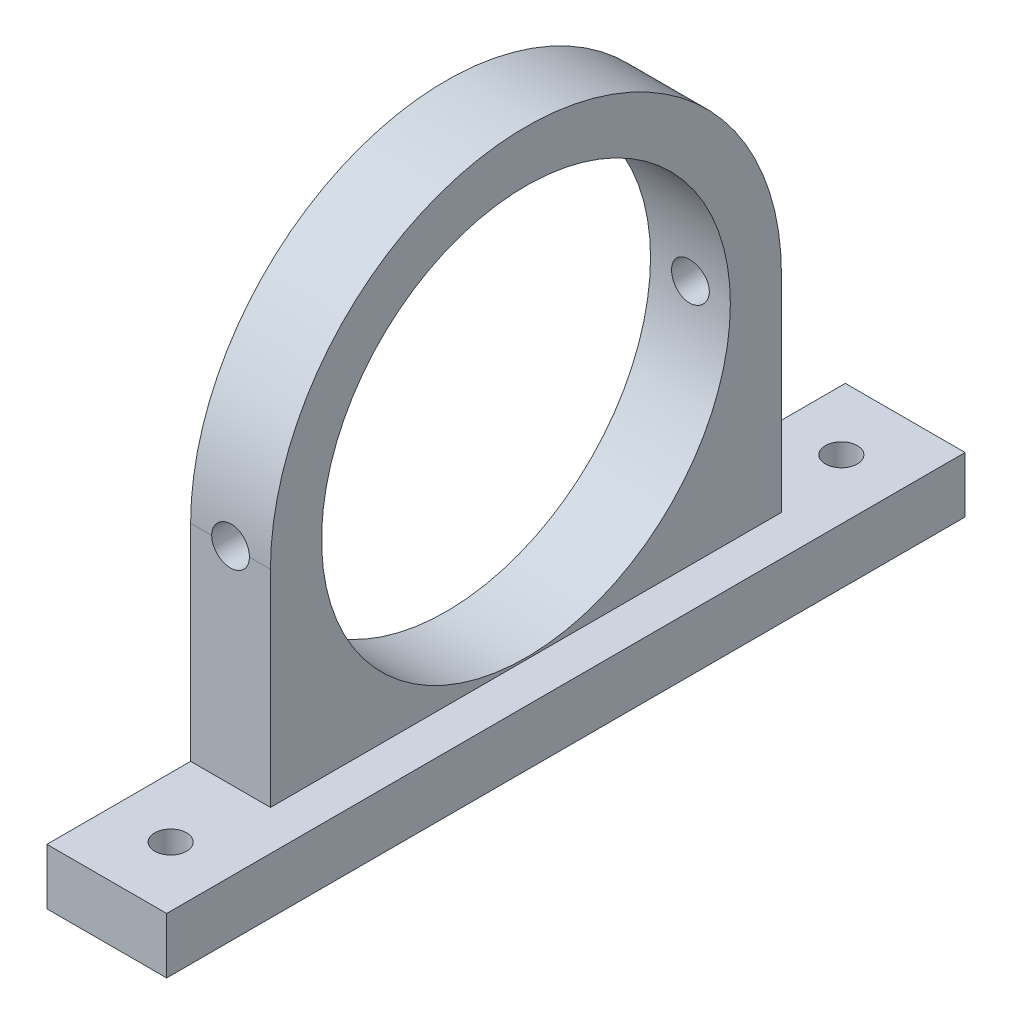
ISO-10303-21;
HEADER;
FILE_DESCRIPTION(('STEP AP214'),'2;1');
FILE_NAME('part.step','',(''),(''),'','','');
FILE_SCHEMA(('AUTOMOTIVE_DESIGN { 1 0 10303 214 1 1 1 1 }'));
ENDSEC;
DATA;
#1=APPLICATION_CONTEXT('core data for automotive mechanical design processes');
#2=APPLICATION_PROTOCOL_DEFINITION('international standard','automotive_design',2000,#1);
#3=PRODUCT_CONTEXT('',#1,'mechanical');
#4=PRODUCT('Part','Part','',(#3));
#5=PRODUCT_RELATED_PRODUCT_CATEGORY('part','',(#4));
#6=PRODUCT_DEFINITION_FORMATION('','',#4);
#7=PRODUCT_DEFINITION_CONTEXT('part definition',#1,'design');
#8=PRODUCT_DEFINITION('design','',#6,#7);
#9=PRODUCT_DEFINITION_SHAPE('','',#8);
#10=(LENGTH_UNIT() NAMED_UNIT(*) SI_UNIT(.MILLI.,.METRE.));
#11=(NAMED_UNIT(*) PLANE_ANGLE_UNIT() SI_UNIT($,.RADIAN.));
#12=(NAMED_UNIT(*) SI_UNIT($,.STERADIAN.) SOLID_ANGLE_UNIT());
#13=UNCERTAINTY_MEASURE_WITH_UNIT(LENGTH_MEASURE(1.E-05),#10,'distance_accuracy_value','');
#14=(GEOMETRIC_REPRESENTATION_CONTEXT(3) GLOBAL_UNCERTAINTY_ASSIGNED_CONTEXT((#13)) GLOBAL_UNIT_ASSIGNED_CONTEXT((#10,
#11,#12)) REPRESENTATION_CONTEXT('',''));
#15=CARTESIAN_POINT('',(0.,0.,0.));
#16=DIRECTION('',(0.,0.,1.));
#17=DIRECTION('',(1.,0.,0.));
#18=AXIS2_PLACEMENT_3D('',#15,#16,#17);
#19=CARTESIAN_POINT('',(3.175,0.,-20.32));
#20=DIRECTION('',(0.,0.,1.));
#21=DIRECTION('',(1.,0.,0.));
#22=AXIS2_PLACEMENT_3D('',#19,#20,#21);
#23=PLANE('',#22);
#24=CARTESIAN_POINT('',(0.,20.8500000000001,-20.3199999999999));
#25=DIRECTION('',(0.,0.,-1.));
#26=DIRECTION('',(0.,1.,0.));
#27=AXIS2_PLACEMENT_3D('',#24,#25,#26);
#28=CIRCLE('',#27,1.5113);
#29=CARTESIAN_POINT('',(1.5113,20.8500000000002,-20.3199999999999));
#30=VERTEX_POINT('',#29);
#31=CARTESIAN_POINT('',(-1.51130000000017,20.85,-20.32));
#32=VERTEX_POINT('',#31);
#33=EDGE_CURVE('E56',#30,#32,#28,.T.);
#34=ORIENTED_EDGE('',*,*,#33,.F.);
#35=DIRECTION('',(-1.,0.,0.));
#36=VECTOR('',#35,1.);
#37=CARTESIAN_POINT('',(3.175,20.85,-20.32));
#38=LINE('',#37,#36);
#39=CARTESIAN_POINT('',(3.175,20.85,-20.32));
#40=VERTEX_POINT('',#39);
#41=EDGE_CURVE('E141',#40,#30,#38,.T.);
#42=ORIENTED_EDGE('',*,*,#41,.F.);
#43=DIRECTION('',(0.,1.,0.));
#44=VECTOR('',#43,1.);
#45=CARTESIAN_POINT('',(3.175,0.,-20.32));
#46=LINE('',#45,#44);
#47=CARTESIAN_POINT('',(3.175,4.445,-20.32));
#48=VERTEX_POINT('',#47);
#49=EDGE_CURVE('E220',#48,#40,#46,.T.);
#50=ORIENTED_EDGE('',*,*,#49,.F.);
#51=DIRECTION('',(-1.,0.,0.));
#52=VECTOR('',#51,1.);
#53=CARTESIAN_POINT('',(3.175,4.445,-20.32));
#54=LINE('',#53,#52);
#55=CARTESIAN_POINT('',(-3.175,4.445,-20.32));
#56=VERTEX_POINT('',#55);
#57=EDGE_CURVE('E146',#48,#56,#54,.T.);
#58=ORIENTED_EDGE('',*,*,#57,.T.);
#59=DIRECTION('',(0.,1.,0.));
#60=VECTOR('',#59,1.);
#61=CARTESIAN_POINT('',(-3.175,0.,-20.32));
#62=LINE('',#61,#60);
#63=CARTESIAN_POINT('',(-3.175,20.85,-20.32));
#64=VERTEX_POINT('',#63);
#65=EDGE_CURVE('E244',#56,#64,#62,.T.);
#66=ORIENTED_EDGE('',*,*,#65,.T.);
#67=EDGE_CURVE('E147',#32,#64,#38,.T.);
#68=ORIENTED_EDGE('',*,*,#67,.F.);
#69=EDGE_LOOP('',(#34,#42,#50,#58,#66,#68));
#70=FACE_BOUND('',#69,.T.);
#71=ADVANCED_FACE('F36',(#70),#23,.F.);
#72=CARTESIAN_POINT('',(3.175,0.,31.75));
#73=DIRECTION('',(0.,0.,1.));
#74=DIRECTION('',(1.,0.,0.));
#75=AXIS2_PLACEMENT_3D('',#72,#73,#74);
#76=PLANE('',#75);
#77=DIRECTION('',(0.,1.,0.));
#78=VECTOR('',#77,1.);
#79=CARTESIAN_POINT('',(-3.175,0.,31.75));
#80=LINE('',#79,#78);
#81=CARTESIAN_POINT('',(-3.175,0.,31.75));
#82=VERTEX_POINT('',#81);
#83=CARTESIAN_POINT('',(-3.175,4.445,31.75));
#84=VERTEX_POINT('',#83);
#85=EDGE_CURVE('E234',#82,#84,#80,.T.);
#86=ORIENTED_EDGE('',*,*,#85,.F.);
#87=DIRECTION('',(-1.,0.,0.));
#88=VECTOR('',#87,1.);
#89=CARTESIAN_POINT('',(3.175,0.,31.75));
#90=LINE('',#89,#88);
#91=CARTESIAN_POINT('',(6.35,0.,31.75));
#92=VERTEX_POINT('',#91);
#93=EDGE_CURVE('E158',#92,#82,#90,.T.);
#94=ORIENTED_EDGE('',*,*,#93,.F.);
#95=DIRECTION('',(0.,-1.,0.));
#96=VECTOR('',#95,1.);
#97=CARTESIAN_POINT('',(6.35,0.,31.75));
#98=LINE('',#97,#96);
#99=CARTESIAN_POINT('',(6.35,4.445,31.75));
#100=VERTEX_POINT('',#99);
#101=EDGE_CURVE('E218',#100,#92,#98,.T.);
#102=ORIENTED_EDGE('',*,*,#101,.F.);
#103=DIRECTION('',(-1.,0.,0.));
#104=VECTOR('',#103,1.);
#105=CARTESIAN_POINT('',(3.175,4.445,31.75));
#106=LINE('',#105,#104);
#107=EDGE_CURVE('E160',#100,#84,#106,.T.);
#108=ORIENTED_EDGE('',*,*,#107,.T.);
#109=EDGE_LOOP('',(#86,#94,#102,#108));
#110=FACE_BOUND('',#109,.T.);
#111=ADVANCED_FACE('F38',(#110),#76,.T.);
#112=CARTESIAN_POINT('',(3.175,0.,0.));
#113=DIRECTION('',(0.,-1.,0.));
#114=DIRECTION('',(0.,0.,-1.));
#115=AXIS2_PLACEMENT_3D('',#112,#113,#114);
#116=PLANE('',#115);
#117=CARTESIAN_POINT('',(1.5875,0.,-26.67));
#118=DIRECTION('',(0.,-1.,0.));
#119=DIRECTION('',(0.,0.,-1.));
#120=AXIS2_PLACEMENT_3D('',#117,#118,#119);
#121=CIRCLE('',#120,1.27);
#122=CARTESIAN_POINT('',(1.5875,0.,-27.94));
#123=VERTEX_POINT('',#122);
#124=EDGE_CURVE('E339',#123,#123,#121,.F.);
#125=ORIENTED_EDGE('',*,*,#124,.T.);
#126=EDGE_LOOP('',(#125));
#127=FACE_BOUND('',#126,.T.);
#128=CARTESIAN_POINT('',(1.5875,0.,26.67));
#129=DIRECTION('',(0.,-1.,0.));
#130=DIRECTION('',(0.,0.,-1.));
#131=AXIS2_PLACEMENT_3D('',#128,#129,#130);
#132=CIRCLE('',#131,1.27);
#133=CARTESIAN_POINT('',(1.5875,0.,25.4));
#134=VERTEX_POINT('',#133);
#135=EDGE_CURVE('E338',#134,#134,#132,.T.);
#136=ORIENTED_EDGE('',*,*,#135,.F.);
#137=EDGE_LOOP('',(#136));
#138=FACE_BOUND('',#137,.T.);
#139=DIRECTION('',(0.,0.,1.));
#140=VECTOR('',#139,1.);
#141=CARTESIAN_POINT('',(-3.175,0.,0.));
#142=LINE('',#141,#140);
#143=CARTESIAN_POINT('',(-3.175,0.,-31.75));
#144=VERTEX_POINT('',#143);
#145=EDGE_CURVE('E238',#144,#82,#142,.T.);
#146=ORIENTED_EDGE('',*,*,#145,.F.);
#147=DIRECTION('',(-1.,0.,0.));
#148=VECTOR('',#147,1.);
#149=CARTESIAN_POINT('',(3.175,0.,-31.75));
#150=LINE('',#149,#148);
#151=CARTESIAN_POINT('',(6.35,0.,-31.75));
#152=VERTEX_POINT('',#151);
#153=EDGE_CURVE('E156',#152,#144,#150,.T.);
#154=ORIENTED_EDGE('',*,*,#153,.F.);
#155=DIRECTION('',(0.,0.,-1.));
#156=VECTOR('',#155,1.);
#157=CARTESIAN_POINT('',(6.35,0.,-31.75));
#158=LINE('',#157,#156);
#159=EDGE_CURVE('E286',#92,#152,#158,.T.);
#160=ORIENTED_EDGE('',*,*,#159,.F.);
#161=ORIENTED_EDGE('',*,*,#93,.T.);
#162=EDGE_LOOP('',(#146,#154,#160,#161));
#163=FACE_BOUND('',#162,.T.);
#164=ADVANCED_FACE('F282',(#127,#138,#163),#116,.T.);
#165=CARTESIAN_POINT('',(3.175,0.,-31.75));
#166=DIRECTION('',(0.,0.,1.));
#167=DIRECTION('',(1.,0.,0.));
#168=AXIS2_PLACEMENT_3D('',#165,#166,#167);
#169=PLANE('',#168);
#170=DIRECTION('',(0.,1.,0.));
#171=VECTOR('',#170,1.);
#172=CARTESIAN_POINT('',(-3.175,0.,-31.75));
#173=LINE('',#172,#171);
#174=CARTESIAN_POINT('',(-3.175,4.445,-31.75));
#175=VERTEX_POINT('',#174);
#176=EDGE_CURVE('E241',#144,#175,#173,.T.);
#177=ORIENTED_EDGE('',*,*,#176,.T.);
#178=DIRECTION('',(-1.,0.,0.));
#179=VECTOR('',#178,1.);
#180=CARTESIAN_POINT('',(3.175,4.445,-31.75));
#181=LINE('',#180,#179);
#182=CARTESIAN_POINT('',(6.35,4.445,-31.75));
#183=VERTEX_POINT('',#182);
#184=EDGE_CURVE('E149',#183,#175,#181,.T.);
#185=ORIENTED_EDGE('',*,*,#184,.F.);
#186=DIRECTION('',(0.,1.,0.));
#187=VECTOR('',#186,1.);
#188=CARTESIAN_POINT('',(6.35,0.,-31.75));
#189=LINE('',#188,#187);
#190=EDGE_CURVE('E291',#152,#183,#189,.T.);
#191=ORIENTED_EDGE('',*,*,#190,.F.);
#192=ORIENTED_EDGE('',*,*,#153,.T.);
#193=EDGE_LOOP('',(#177,#185,#191,#192));
#194=FACE_BOUND('',#193,.T.);
#195=ADVANCED_FACE('F279',(#194),#169,.F.);
#196=CARTESIAN_POINT('',(3.175,4.445,0.));
#197=DIRECTION('',(0.,1.,0.));
#198=DIRECTION('',(0.,0.,1.));
#199=AXIS2_PLACEMENT_3D('',#196,#197,#198);
#200=PLANE('',#199);
#201=CARTESIAN_POINT('',(1.5875,4.445,-26.67));
#202=DIRECTION('',(0.,-1.,0.));
#203=DIRECTION('',(0.,0.,-1.));
#204=AXIS2_PLACEMENT_3D('',#201,#202,#203);
#205=CIRCLE('',#204,1.27);
#206=CARTESIAN_POINT('',(1.5875,4.445,-27.94));
#207=VERTEX_POINT('',#206);
#208=EDGE_CURVE('E333',#207,#207,#205,.T.);
#209=ORIENTED_EDGE('',*,*,#208,.T.);
#210=EDGE_LOOP('',(#209));
#211=FACE_BOUND('',#210,.T.);
#212=CARTESIAN_POINT('',(1.5875,4.445,26.67));
#213=DIRECTION('',(0.,1.,0.));
#214=DIRECTION('',(0.,0.,1.));
#215=AXIS2_PLACEMENT_3D('',#212,#213,#214);
#216=CIRCLE('',#215,1.27);
#217=CARTESIAN_POINT('',(1.5875,4.445,27.94));
#218=VERTEX_POINT('',#217);
#219=EDGE_CURVE('E336',#218,#218,#216,.T.);
#220=ORIENTED_EDGE('',*,*,#219,.F.);
#221=EDGE_LOOP('',(#220));
#222=FACE_BOUND('',#221,.T.);
#223=DIRECTION('',(0.,0.,-1.));
#224=VECTOR('',#223,1.);
#225=CARTESIAN_POINT('',(-3.175,4.445,0.));
#226=LINE('',#225,#224);
#227=EDGE_CURVE('E235',#56,#175,#226,.T.);
#228=ORIENTED_EDGE('',*,*,#227,.F.);
#229=ORIENTED_EDGE('',*,*,#57,.F.);
#230=DIRECTION('',(0.,0.,1.));
#231=VECTOR('',#230,1.);
#232=CARTESIAN_POINT('',(3.175,4.445,31.75));
#233=LINE('',#232,#231);
#234=CARTESIAN_POINT('',(3.175,4.445,20.32));
#235=VERTEX_POINT('',#234);
#236=EDGE_CURVE('E162',#48,#235,#233,.T.);
#237=ORIENTED_EDGE('',*,*,#236,.T.);
#238=DIRECTION('',(-1.,0.,0.));
#239=VECTOR('',#238,1.);
#240=CARTESIAN_POINT('',(3.175,4.445,20.32));
#241=LINE('',#240,#239);
#242=CARTESIAN_POINT('',(-3.175,4.445,20.32));
#243=VERTEX_POINT('',#242);
#244=EDGE_CURVE('E230',#235,#243,#241,.T.);
#245=ORIENTED_EDGE('',*,*,#244,.T.);
#246=EDGE_CURVE('E231',#84,#243,#226,.T.);
#247=ORIENTED_EDGE('',*,*,#246,.F.);
#248=ORIENTED_EDGE('',*,*,#107,.F.);
#249=DIRECTION('',(0.,0.,1.));
#250=VECTOR('',#249,1.);
#251=CARTESIAN_POINT('',(6.35,4.445,31.75));
#252=LINE('',#251,#250);
#253=EDGE_CURVE('E275',#183,#100,#252,.T.);
#254=ORIENTED_EDGE('',*,*,#253,.F.);
#255=ORIENTED_EDGE('',*,*,#184,.T.);
#256=EDGE_LOOP('',(#228,#229,#237,#245,#247,#248,#254,#255));
#257=FACE_BOUND('',#256,.T.);
#258=ADVANCED_FACE('F203',(#211,#222,#257),#200,.T.);
#259=CARTESIAN_POINT('',(3.175,20.85,0.));
#260=DIRECTION('',(-1.,0.,0.));
#261=DIRECTION('',(0.,0.,1.));
#262=AXIS2_PLACEMENT_3D('',#259,#260,#261);
#263=CYLINDRICAL_SURFACE('',#262,20.32);
#264=CARTESIAN_POINT('',(1.500000048,20.85,20.32));
#265=CARTESIAN_POINT('',(1.49999983587005,20.8921400952631,20.3200007331279));
#266=CARTESIAN_POINT('',(1.49822314498622,20.9342599462541,20.3198687467585));
#267=CARTESIAN_POINT('',(1.49113564784249,21.0181971462007,20.3193471095665));
#268=CARTESIAN_POINT('',(1.48582504611599,21.0600145125217,20.3189574736559));
#269=CARTESIAN_POINT('',(1.4646444564112,21.1844854300185,20.3174154853349));
#270=CARTESIAN_POINT('',(1.44352553475765,21.266303431948,20.3158900003548));
#271=CARTESIAN_POINT('',(1.3878852984627,21.4252172582659,20.312012809638));
#272=CARTESIAN_POINT('',(1.3533583976225,21.5023110988948,20.3096607595662));
#273=CARTESIAN_POINT('',(1.2718901292436,21.6496085785074,20.3043950497946));
#274=CARTESIAN_POINT('',(1.22495068924397,21.7198132849836,20.3014814773124));
#275=CARTESIAN_POINT('',(1.11989277454509,21.8514722977573,20.2954136048815));
#276=CARTESIAN_POINT('',(1.06175531866697,21.9129114337204,20.2922589017606));
#277=CARTESIAN_POINT('',(0.935983476281679,22.0251770996436,20.2860673293668));
#278=CARTESIAN_POINT('',(0.868347644264949,22.0760020113454,20.2830304781192));
#279=CARTESIAN_POINT('',(0.725411715813101,22.165637555332,20.2774141487992));
#280=CARTESIAN_POINT('',(0.650103182236045,22.2044347679339,20.2748351829646));
#281=CARTESIAN_POINT('',(0.494023351415337,22.2688259574698,20.2704311863708));
#282=CARTESIAN_POINT('',(0.413252465868012,22.2944209282023,20.2686060988655));
#283=CARTESIAN_POINT('',(0.248692388214075,22.3316394966262,20.2659195598592));
#284=CARTESIAN_POINT('',(0.164908956834858,22.3432884368658,20.2650563606253));
#285=CARTESIAN_POINT('',(-0.003430209858871,22.3523626092793,20.2643857132789));
#286=CARTESIAN_POINT('',(-0.0879859525044627,22.3497877062946,20.2645782751984));
#287=CARTESIAN_POINT('',(-0.255291655386111,22.330507763423,20.2659958500506));
#288=CARTESIAN_POINT('',(-0.338044850434374,22.3138306234251,20.2672188243964));
#289=CARTESIAN_POINT('',(-0.499573774818422,22.2668629761492,20.2705562057428));
#290=CARTESIAN_POINT('',(-0.578349491168769,22.2365724244303,20.2726706156536));
#291=CARTESIAN_POINT('',(-0.7297784949524,22.1632056693041,20.277555009273));
#292=CARTESIAN_POINT('',(-0.80242553509377,22.1201166171597,20.2803256512204));
#293=CARTESIAN_POINT('',(-0.939462898383264,22.0223872746132,20.2862095070852));
#294=CARTESIAN_POINT('',(-1.00385347497475,21.9677473389177,20.2893227104817));
#295=CARTESIAN_POINT('',(-1.12270769278604,21.8483193458721,20.2955496161446));
#296=CARTESIAN_POINT('',(-1.17714854042651,21.7835086039477,20.2986633035978));
#297=CARTESIAN_POINT('',(-1.2743979183403,21.6456300648417,20.3045345933432));
#298=CARTESIAN_POINT('',(-1.31720283996456,21.5725597160333,20.3072920850296));
#299=CARTESIAN_POINT('',(-1.38996187626789,21.4202124161279,20.3121409515968));
#300=CARTESIAN_POINT('',(-1.4199072741352,21.3409312979778,20.3142318743982));
#301=CARTESIAN_POINT('',(-1.46601021321444,21.1785080755346,20.3175059570439));
#302=CARTESIAN_POINT('',(-1.48218869547125,21.0953720388923,20.3186904953246));
#303=CARTESIAN_POINT('',(-1.49418333522326,20.9847228614175,20.3195713766483));
#304=CARTESIAN_POINT('',(-1.49636571930293,20.9578009745128,20.3197320200334));
#305=CARTESIAN_POINT('',(-1.49927209495763,20.9039230844668,20.3199461940273));
#306=CARTESIAN_POINT('',(-1.49999850870271,20.8769672127623,20.3199999025334));
#307=CARTESIAN_POINT('',(-1.500000048,20.85,20.32));
#308=B_SPLINE_CURVE_WITH_KNOTS('',3,(#264,#265,#266,#267,#268,#269,#270,#271,#272,#273,#274,
#275,#276,#277,#278,#279,#280,#281,#282,#283,#284,#285,#286,#287,#288,#289,#290,#291,#292,#293,
#294,#295,#296,#297,#298,#299,#300,#301,#302,#303,#304,#305,#306,#307),.UNSPECIFIED.,.F.,.F.,(4,
2,2,2,2,2,2,2,2,2,2,2,2,2,2,2,2,2,2,2,2,4),(0.,0.126342457749605,0.252677603768744,
0.504916571643246,0.757260743393832,1.0095657516908,1.26230225387807,1.51507726051383,
1.7681332895295,2.02117026697576,2.27374672751432,2.52632558810391,2.77840591223494,
3.03048705928981,3.28282213728501,3.53514946765702,3.78804779427124,4.04102446297986,
4.29417234195641,4.54693446234536,4.62793846464693,4.70880759547446),.UNSPECIFIED.);
#309=CARTESIAN_POINT('',(1.500000048,20.85,20.32));
#310=VERTEX_POINT('',#309);
#311=CARTESIAN_POINT('',(-1.500000048,20.85,20.32));
#312=VERTEX_POINT('',#311);
#313=EDGE_CURVE('E131',#310,#312,#308,.T.);
#314=ORIENTED_EDGE('',*,*,#313,.F.);
#315=DIRECTION('',(-1.,0.,0.));
#316=VECTOR('',#315,1.);
#317=CARTESIAN_POINT('',(3.175,20.85,20.32));
#318=LINE('',#317,#316);
#319=CARTESIAN_POINT('',(3.175,20.85,20.32));
#320=VERTEX_POINT('',#319);
#321=EDGE_CURVE('E151',#320,#310,#318,.T.);
#322=ORIENTED_EDGE('',*,*,#321,.F.);
#323=CARTESIAN_POINT('',(3.175,20.85,0.));
#324=DIRECTION('',(1.,0.,0.));
#325=DIRECTION('',(0.,0.,-1.));
#326=AXIS2_PLACEMENT_3D('',#323,#324,#325);
#327=CIRCLE('',#326,20.32);
#328=EDGE_CURVE('E143',#320,#40,#327,.F.);
#329=ORIENTED_EDGE('',*,*,#328,.T.);
#330=ORIENTED_EDGE('',*,*,#41,.T.);
#331=CARTESIAN_POINT('',(1.34685122903031,21.5071824292716,-20.3093700358888));
#332=CARTESIAN_POINT('',(1.38094452601419,21.4430768130744,-20.3114542048142));
#333=CARTESIAN_POINT('',(1.41006112285406,21.3763030627661,-20.3133014348057));
#334=CARTESIAN_POINT('',(1.45716548978022,21.240620312264,-20.3163534791984));
#335=CARTESIAN_POINT('',(1.4753897560106,21.1717935986033,-20.317571860513));
#336=CARTESIAN_POINT('',(1.50036038159987,21.0363116990314,-20.3192519144608));
#337=CARTESIAN_POINT('',(1.50772461894439,20.9697706227639,-20.3197542624667));
#338=CARTESIAN_POINT('',(1.51290358214616,20.8348678348415,-20.3201111037872));
#339=CARTESIAN_POINT('',(1.5105073729729,20.7664979752316,-20.3199512856236));
#340=CARTESIAN_POINT('',(1.50302943949242,20.69867,-20.3194364890147));
#341=B_SPLINE_CURVE_WITH_KNOTS('',3,(#331,#332,#333,#334,#335,#336,#337,#338,#339,#340),
.UNSPECIFIED.,.F.,.F.,(4,2,2,2,4),(0.,0.217722021741247,0.430526715072884,0.630681849396229,
0.835185275993468),.UNSPECIFIED.);
#342=CARTESIAN_POINT('',(1.36555859752515,21.4706849931529,-20.3105182144443));
#343=VERTEX_POINT('',#342);
#344=EDGE_CURVE('E11',#343,#30,#341,.T.);
#345=ORIENTED_EDGE('',*,*,#344,.F.);
#346=CARTESIAN_POINT('',(-1.36555859752515,21.4706849931529,-20.3105182144443));
#347=CARTESIAN_POINT('',(-1.34808563523262,21.5091262377826,-20.3093439327099));
#348=CARTESIAN_POINT('',(-1.32899844659242,21.546808667928,-20.3080825713122));
#349=CARTESIAN_POINT('',(-1.28772136657057,21.6204261446339,-20.3054228426025));
#350=CARTESIAN_POINT('',(-1.2655316502958,21.6563612896572,-20.304024483024));
#351=CARTESIAN_POINT('',(-1.19456927040162,21.7610966144915,-20.2996840137558));
#352=CARTESIAN_POINT('',(-1.1413470834839,21.8269501900224,-20.2965925486025));
#353=CARTESIAN_POINT('',(-1.02460558027596,21.9487785119641,-20.2903628727136));
#354=CARTESIAN_POINT('',(-0.961081821742843,22.0047489747328,-20.2872246423444));
#355=CARTESIAN_POINT('',(-0.825532493552681,22.1052323252488,-20.2812556130008));
#356=CARTESIAN_POINT('',(-0.753508516410576,22.1497473542156,-20.2784247566302));
#357=CARTESIAN_POINT('',(-0.602983510980622,22.226057189463,-20.2733898765727));
#358=CARTESIAN_POINT('',(-0.524481849126082,22.2578507497044,-20.2711859142947));
#359=CARTESIAN_POINT('',(-0.363223601936304,22.3078044298454,-20.2676549718764));
#360=CARTESIAN_POINT('',(-0.280466518795632,22.3259629508037,-20.2663280945914));
#361=CARTESIAN_POINT('',(-0.113264275713124,22.3480875994359,-20.2647047483395));
#362=CARTESIAN_POINT('',(-0.0288235231895242,22.3520868662506,-20.2644058734231));
#363=CARTESIAN_POINT('',(0.139527342982087,22.345869978053,-20.2648657062601));
#364=CARTESIAN_POINT('',(0.223437475597961,22.3356543340941,-20.2656243759928));
#365=CARTESIAN_POINT('',(0.388234923659923,22.3013266775786,-20.2681114812779));
#366=CARTESIAN_POINT('',(0.469126028554555,22.2772327554805,-20.2698386543001));
#367=CARTESIAN_POINT('',(0.625715693727424,22.2158519512826,-20.2740669027828));
#368=CARTESIAN_POINT('',(0.701414265068216,22.178565097291,-20.2765679765944));
#369=CARTESIAN_POINT('',(0.845619679815749,22.0917824626708,-20.2820675206806));
#370=CARTESIAN_POINT('',(0.914113059382728,22.0422643846195,-20.2850668960485));
#371=CARTESIAN_POINT('',(1.04182172017819,21.9324487216477,-20.2912227367372));
#372=CARTESIAN_POINT('',(1.10103905803975,21.8721535325346,-20.2943791670314));
#373=CARTESIAN_POINT('',(1.1971656593633,21.7562058633118,-20.2998473099951));
#374=CARTESIAN_POINT('',(1.23614588165523,21.7022552941351,-20.3021967980727));
#375=CARTESIAN_POINT('',(1.30661198434627,21.5897192618909,-20.306610338306));
#376=CARTESIAN_POINT('',(1.33810432114868,21.5311378502603,-20.3086746357181));
#377=CARTESIAN_POINT('',(1.36555859752515,21.4706849931529,-20.3105182144443));
#378=B_SPLINE_CURVE_WITH_KNOTS('',3,(#346,#347,#348,#349,#350,#351,#352,#353,#354,#355,#356,
#357,#358,#359,#360,#361,#362,#363,#364,#365,#366,#367,#368,#369,#370,#371,#372,#373,#374,#375,
#376,#377),.UNSPECIFIED.,.F.,.F.,(4,2,2,2,2,2,2,2,2,2,2,2,2,2,2,4),(0.,0.126648729331324,
0.25329031348222,0.506171308147987,0.759161641527465,1.01210465221579,1.26507243203993,
1.51806987202947,1.7704747892421,2.0228706322444,2.27493821717004,2.52700526505577,
2.7795352651337,3.03200919615469,3.23124609149022,3.43031056741027),.UNSPECIFIED.);
#379=CARTESIAN_POINT('',(-1.36555859752515,21.4706849931529,-20.3105182144443));
#380=VERTEX_POINT('',#379);
#381=EDGE_CURVE('E124',#380,#343,#378,.T.);
#382=ORIENTED_EDGE('',*,*,#381,.F.);
#383=CARTESIAN_POINT('',(-1.50302943949242,20.69867,-20.3194364890147));
#384=CARTESIAN_POINT('',(-1.51107951662369,20.7715317014277,-20.3199926302962));
#385=CARTESIAN_POINT('',(-1.51324099896157,20.8450286780497,-20.3201347165824));
#386=CARTESIAN_POINT('',(-1.5060853141641,20.9897818027216,-20.3196417995429));
#387=CARTESIAN_POINT('',(-1.49702830115987,21.0610508773845,-20.3190244105114));
#388=CARTESIAN_POINT('',(-1.46917970376695,21.195968084893,-20.3171584172581));
#389=CARTESIAN_POINT('',(-1.45118347971981,21.2597828226785,-20.3159615615261));
#390=CARTESIAN_POINT('',(-1.40596628966257,21.3856012906166,-20.313041050484));
#391=CARTESIAN_POINT('',(-1.37855525327475,21.4475365549192,-20.3113066190132));
#392=CARTESIAN_POINT('',(-1.34685122903031,21.5071824292716,-20.3093700358888));
#393=B_SPLINE_CURVE_WITH_KNOTS('',3,(#383,#384,#385,#386,#387,#388,#389,#390,#391,#392),
.UNSPECIFIED.,.F.,.F.,(4,2,2,2,4),(0.,0.219667837513881,0.434335653724413,0.632626528111379,
0.835181997982693),.UNSPECIFIED.);
#394=EDGE_CURVE('E50',#32,#380,#393,.T.);
#395=ORIENTED_EDGE('',*,*,#394,.F.);
#396=ORIENTED_EDGE('',*,*,#67,.T.);
#397=CARTESIAN_POINT('',(-3.175,20.85,0.));
#398=DIRECTION('',(1.,0.,0.));
#399=DIRECTION('',(0.,0.,-1.));
#400=AXIS2_PLACEMENT_3D('',#397,#398,#399);
#401=CIRCLE('',#400,20.32);
#402=CARTESIAN_POINT('',(-3.175,20.85,20.32));
#403=VERTEX_POINT('',#402);
#404=EDGE_CURVE('E247',#403,#64,#401,.F.);
#405=ORIENTED_EDGE('',*,*,#404,.F.);
#406=EDGE_CURVE('E254',#312,#403,#318,.T.);
#407=ORIENTED_EDGE('',*,*,#406,.F.);
#408=EDGE_LOOP('',(#314,#322,#329,#330,#345,#382,#395,#396,#405,#407));
#409=FACE_BOUND('',#408,.T.);
#410=ADVANCED_FACE('F138',(#409),#263,.T.);
#411=CARTESIAN_POINT('',(3.175,0.,20.32));
#412=DIRECTION('',(0.,0.,1.));
#413=DIRECTION('',(1.,0.,0.));
#414=AXIS2_PLACEMENT_3D('',#411,#412,#413);
#415=PLANE('',#414);
#416=CARTESIAN_POINT('',(0.,20.8499999999998,20.32));
#417=DIRECTION('',(0.,0.,1.));
#418=DIRECTION('',(1.,0.,0.));
#419=AXIS2_PLACEMENT_3D('',#416,#417,#418);
#420=CIRCLE('',#419,1.500000048);
#421=EDGE_CURVE('E63',#312,#310,#420,.T.);
#422=ORIENTED_EDGE('',*,*,#421,.F.);
#423=ORIENTED_EDGE('',*,*,#406,.T.);
#424=DIRECTION('',(0.,1.,0.));
#425=VECTOR('',#424,1.);
#426=CARTESIAN_POINT('',(-3.175,0.,20.32));
#427=LINE('',#426,#425);
#428=EDGE_CURVE('E250',#243,#403,#427,.T.);
#429=ORIENTED_EDGE('',*,*,#428,.F.);
#430=ORIENTED_EDGE('',*,*,#244,.F.);
#431=DIRECTION('',(0.,1.,0.));
#432=VECTOR('',#431,1.);
#433=CARTESIAN_POINT('',(3.175,0.,20.32));
#434=LINE('',#433,#432);
#435=EDGE_CURVE('E224',#235,#320,#434,.T.);
#436=ORIENTED_EDGE('',*,*,#435,.T.);
#437=ORIENTED_EDGE('',*,*,#321,.T.);
#438=EDGE_LOOP('',(#422,#423,#429,#430,#436,#437));
#439=FACE_BOUND('',#438,.T.);
#440=ADVANCED_FACE('F202',(#439),#415,.T.);
#441=CARTESIAN_POINT('',(3.175,20.85,0.));
#442=DIRECTION('',(-1.,0.,0.));
#443=DIRECTION('',(0.,0.,1.));
#444=AXIS2_PLACEMENT_3D('',#441,#442,#443);
#445=CYLINDRICAL_SURFACE('',#444,16.256);
#446=CARTESIAN_POINT('',(1.500000048,20.85,16.256));
#447=CARTESIAN_POINT('',(1.49999639191281,20.7659361322014,16.2559991005268));
#448=CARTESIAN_POINT('',(1.49290953256135,20.681815883796,16.2553409870406));
#449=CARTESIAN_POINT('',(1.46474435756792,20.5159052419545,16.2527789213239));
#450=CARTESIAN_POINT('',(1.44365041492887,20.4341175572525,16.2508735776553));
#451=CARTESIAN_POINT('',(1.38808837838571,20.2752987824025,16.2460322444789));
#452=CARTESIAN_POINT('',(1.35362811448762,20.1982649380162,16.243096858467));
#453=CARTESIAN_POINT('',(1.27232626755218,20.0510923908959,16.236524134361));
#454=CARTESIAN_POINT('',(1.22548723696591,19.9809522707899,16.2328869410185));
#455=CARTESIAN_POINT('',(1.12060176232974,19.8493239436691,16.2253058158185));
#456=CARTESIAN_POINT('',(1.0625249276535,19.7878599975059,16.2213610699145));
#457=CARTESIAN_POINT('',(0.936877005872284,19.6755371132343,16.2136162157909));
#458=CARTESIAN_POINT('',(0.869305490765618,19.6246786534573,16.2098161141012));
#459=CARTESIAN_POINT('',(0.726436652485465,19.5349261784501,16.2027823072587));
#460=CARTESIAN_POINT('',(0.651125658704052,19.4960538365418,16.1995496326206));
#461=CARTESIAN_POINT('',(0.495010686681426,19.4315154512846,16.1940264582453));
#462=CARTESIAN_POINT('',(0.414206825320904,19.4058491270292,16.1917359384676));
#463=CARTESIAN_POINT('',(0.249645403729466,19.3685225895562,16.1883635537951));
#464=CARTESIAN_POINT('',(0.165896972626516,19.3568224452098,16.1872782436721));
#465=CARTESIAN_POINT('',(-0.00238146686743828,19.3476369933237,16.1864283831261));
#466=CARTESIAN_POINT('',(-0.0869114575317361,19.3501513641676,16.1866638028204));
#467=CARTESIAN_POINT('',(-0.254079047595769,19.369290614761,16.1884256626688));
#468=CARTESIAN_POINT('',(-0.336721675254126,19.3858719940305,16.1899481227588));
#469=CARTESIAN_POINT('',(-0.49804591502235,19.432606941283,16.1941062924031));
#470=CARTESIAN_POINT('',(-0.576727480791783,19.4627606680079,16.1967420149781));
#471=CARTESIAN_POINT('',(-0.728034122535222,19.5358327074124,16.2028343129802));
#472=CARTESIAN_POINT('',(-0.800649774797572,19.5787704251791,16.2062921346697));
#473=CARTESIAN_POINT('',(-0.937660209085292,19.6761776375498,16.2136379243221));
#474=CARTESIAN_POINT('',(-1.00205478642348,19.7306474191879,16.2175259029906));
#475=CARTESIAN_POINT('',(-1.12104799914043,19.8498160193103,16.225311654021));
#476=CARTESIAN_POINT('',(-1.17560900050441,19.9145524246669,16.2292094084464));
#477=CARTESIAN_POINT('',(-1.27309492976158,20.0522858293033,16.2365617107698));
#478=CARTESIAN_POINT('',(-1.31601984736543,20.1252828358877,16.2400162582759));
#479=CARTESIAN_POINT('',(-1.38901321387061,20.2774906173246,16.2460938087132));
#480=CARTESIAN_POINT('',(-1.41907987126824,20.3567022562254,16.2487166957584));
#481=CARTESIAN_POINT('',(-1.46547625365499,20.5190789996358,16.2528341512851));
#482=CARTESIAN_POINT('',(-1.48180632828214,20.6022440034634,16.2543287484847));
#483=CARTESIAN_POINT('',(-1.50021852269209,20.7698406737706,16.2560175376767));
#484=CARTESIAN_POINT('',(-1.50235259895556,20.8542665865402,16.2562164716607));
#485=CARTESIAN_POINT('',(-1.49244850812882,21.0222749241846,16.2553042109376));
#486=CARTESIAN_POINT('',(-1.48041050362699,21.105857358725,16.2541930312608));
#487=CARTESIAN_POINT('',(-1.44254705044546,21.2696570628866,16.2507884988402));
#488=CARTESIAN_POINT('',(-1.41674581017708,21.3498799752431,16.2484972220346));
#489=CARTESIAN_POINT('',(-1.35211309189045,21.5048585044371,16.2429897098572));
#490=CARTESIAN_POINT('',(-1.31328136320883,21.5796140160662,16.2397734566921));
#491=CARTESIAN_POINT('',(-1.22356027293781,21.7217713676494,16.2327643088875));
#492=CARTESIAN_POINT('',(-1.17263663702183,21.789151494195,16.2289697863084));
#493=CARTESIAN_POINT('',(-1.06022658880931,21.9144259040459,16.2212354767359));
#494=CARTESIAN_POINT('',(-0.998739951264855,21.9723199850171,16.2172956866463));
#495=CARTESIAN_POINT('',(-0.866723177476505,22.077158245508,16.2097007225233));
#496=CARTESIAN_POINT('',(-0.79616597728896,22.1240684198262,16.2060464551152));
#497=CARTESIAN_POINT('',(-0.648145018379294,22.2053737879046,16.1994496479253));
#498=CARTESIAN_POINT('',(-0.570681341856793,22.2397691305892,16.1965070996743));
#499=CARTESIAN_POINT('',(-0.41116479805074,22.2950110637951,16.1916723063172));
#500=CARTESIAN_POINT('',(-0.32911908584835,22.3158781704551,16.1897784714326));
#501=CARTESIAN_POINT('',(-0.162670169105406,22.3435379720853,16.1872504241917));
#502=CARTESIAN_POINT('',(-0.0782670213224092,22.3503310056071,16.1866161815361));
#503=CARTESIAN_POINT('',(0.090162915255264,22.3496455213032,16.186679678495));
#504=CARTESIAN_POINT('',(0.174189928485051,22.3422204258153,16.1873724321372));
#505=CARTESIAN_POINT('',(0.339797763424983,22.3134211675724,16.1900012535409));
#506=CARTESIAN_POINT('',(0.421378581873491,22.2920469862192,16.1919373229601));
#507=CARTESIAN_POINT('',(0.579779696573469,22.2359704602453,16.1968332823527));
#508=CARTESIAN_POINT('',(0.656600449688901,22.2012693970272,16.1997930738908));
#509=CARTESIAN_POINT('',(0.803335139314614,22.119529842128,16.2064031755815));
#510=CARTESIAN_POINT('',(0.873249148245756,22.0724914798288,16.2100534784925));
#511=CARTESIAN_POINT('',(1.00445944746971,21.9672117275625,16.2176496914985));
#512=CARTESIAN_POINT('',(1.06572380891754,21.9089306175371,16.2215966184411));
#513=CARTESIAN_POINT('',(1.17762816140827,21.782895808926,16.2293320505949));
#514=CARTESIAN_POINT('',(1.22826559178788,21.7151398338174,16.2331205174478));
#515=CARTESIAN_POINT('',(1.31756296010809,21.5719195874676,16.2401205650482));
#516=CARTESIAN_POINT('',(1.35619636074755,21.4964387213062,16.2433308611447));
#517=CARTESIAN_POINT('',(1.42019018492601,21.3400815608149,16.2487984274607));
#518=CARTESIAN_POINT('',(1.4455657158733,21.2592115265257,16.2510567818528));
#519=CARTESIAN_POINT('',(1.47593016217482,21.1232284739023,16.2537925624778));
#520=CARTESIAN_POINT('',(1.48494420050104,21.0689873629187,16.25461653615));
#521=CARTESIAN_POINT('',(1.49698032780525,20.9598388578808,16.2557205478705));
#522=CARTESIAN_POINT('',(1.5000024370672,20.9049314660827,16.2560005877601));
#523=CARTESIAN_POINT('',(1.500000048,20.85,16.256));
#524=B_SPLINE_CURVE_WITH_KNOTS('',3,(#446,#447,#448,#449,#450,#451,#452,#453,#454,#455,#456,
#457,#458,#459,#460,#461,#462,#463,#464,#465,#466,#467,#468,#469,#470,#471,#472,#473,#474,#475,
#476,#477,#478,#479,#480,#481,#482,#483,#484,#485,#486,#487,#488,#489,#490,#491,#492,#493,#494,
#495,#496,#497,#498,#499,#500,#501,#502,#503,#504,#505,#506,#507,#508,#509,#510,#511,#512,#513,
#514,#515,#516,#517,#518,#519,#520,#521,#522,#523),.UNSPECIFIED.,.T.,.F.,(4,2,2,2,2,2,2,2,2,2,2,
2,2,2,2,2,2,2,2,2,2,2,2,2,2,2,2,2,2,2,2,2,2,2,2,2,2,2,4),(0.,0.251991028590078,
0.504263664272942,0.756388741011927,1.00846187109666,1.26122646333718,1.51400245337039,
1.76723286877754,2.02045789747428,2.27295717526153,2.52545074004369,2.77716633400201,
3.02888487209514,3.28098746409126,3.53309633167906,3.78615045260033,4.03920479728662,
4.29229438781555,4.54537753624564,4.79753390385339,5.04968737863978,5.30139879139437,
5.55311504651897,5.80555348851038,6.05799731422654,6.31121264449646,6.56442496144599,
6.81725236737896,7.07007369148406,7.32194694367142,7.57382053167938,7.82566990767113,
8.07751664260877,8.33026999741642,8.5830841858732,8.83645335810574,9.08953318173042,
9.25419707195849,9.41886040476267),.UNSPECIFIED.);
#525=CARTESIAN_POINT('',(1.500000048,20.85,16.256));
#526=VERTEX_POINT('',#525);
#527=EDGE_CURVE('E132',#526,#526,#524,.T.);
#528=ORIENTED_EDGE('',*,*,#527,.F.);
#529=EDGE_LOOP('',(#528));
#530=FACE_BOUND('',#529,.T.);
#531=CARTESIAN_POINT('',(0.,22.3500000480001,-16.186646837934));
#532=CARTESIAN_POINT('',(-0.084063008777551,22.3499963911418,-16.1866477517672));
#533=CARTESIAN_POINT('',(-0.168182400905982,22.3429096717312,-16.1873087453824));
#534=CARTESIAN_POINT('',(-0.334091263616507,22.3147451031297,-16.1898811000056));
#535=CARTESIAN_POINT('',(-0.415878024792338,22.293651623982,-16.191793857806));
#536=CARTESIAN_POINT('',(-0.574694846936801,22.2380909433287,-16.1966512737178));
#537=CARTESIAN_POINT('',(-0.651727669964157,22.2036315938802,-16.1995953258757));
#538=CARTESIAN_POINT('',(-0.798898506140411,22.1223319003318,-16.2061828584431));
#539=CARTESIAN_POINT('',(-0.869037935384835,22.0754941064338,-16.209826194744));
#540=CARTESIAN_POINT('',(-1.00066704427548,21.9706098803475,-16.2174145151793));
#541=CARTESIAN_POINT('',(-1.06213224385108,21.912532781308,-16.2213603063655));
#542=CARTESIAN_POINT('',(-1.17445754675257,21.7868838047484,-16.2291015905135));
#543=CARTESIAN_POINT('',(-1.22531717559085,21.7193115026443,-16.2328970767445));
#544=CARTESIAN_POINT('',(-1.31507087179273,21.5764419764626,-16.2399179355423));
#545=CARTESIAN_POINT('',(-1.35394348090382,21.5011312171001,-16.2431422813576));
#546=CARTESIAN_POINT('',(-1.41848242485377,21.3450167546295,-16.2486488177586));
#547=CARTESIAN_POINT('',(-1.44414903742229,21.2642131670792,-16.2509310281579));
#548=CARTESIAN_POINT('',(-1.4814761792711,21.0996525770509,-16.2542904962324));
#549=CARTESIAN_POINT('',(-1.49317666424135,21.0159047089603,-16.2553711907132));
#550=CARTESIAN_POINT('',(-1.50236299243613,20.8476273713342,-16.2562175317534));
#551=CARTESIAN_POINT('',(-1.49984915360581,20.7630979193233,-16.2559832077272));
#552=CARTESIAN_POINT('',(-1.4807107437696,20.5959279788553,-16.2542287373146));
#553=CARTESIAN_POINT('',(-1.46412913774679,20.5132825247447,-16.2527125061058));
#554=CARTESIAN_POINT('',(-1.41739275666192,20.3519527490908,-16.248569189435));
#555=CARTESIAN_POINT('',(-1.38723782797125,20.2732684723929,-16.2459420913997));
#556=CARTESIAN_POINT('',(-1.31416330299668,20.1219585504333,-16.2398657561947));
#557=CARTESIAN_POINT('',(-1.27122458259402,20.0493421924919,-16.2364152888385));
#558=CARTESIAN_POINT('',(-1.17381523199848,19.9123307723747,-16.2290796730812));
#559=CARTESIAN_POINT('',(-1.11934431424169,19.8479359152722,-16.225194513842));
#560=CARTESIAN_POINT('',(-1.00017491020702,19.7289439916486,-16.2174087291345));
#561=CARTESIAN_POINT('',(-0.935439068520102,19.6743843295789,-16.2135080999821));
#562=CARTESIAN_POINT('',(-0.79770726813501,19.5769008336672,-16.206145501728));
#563=CARTESIAN_POINT('',(-0.724711300176457,19.5339770128702,-16.2026835331181));
#564=CARTESIAN_POINT('',(-0.572503795939465,19.4609844346279,-16.1965897678649));
#565=CARTESIAN_POINT('',(-0.49329123189609,19.4309178081323,-16.1939581088559));
#566=CARTESIAN_POINT('',(-0.330912478191352,19.3845217712318,-16.1898257218038));
#567=CARTESIAN_POINT('',(-0.247746390824249,19.3681920056009,-16.1883249645164));
#568=CARTESIAN_POINT('',(-0.0801492230900744,19.3497809760469,-16.1866292261934));
#569=CARTESIAN_POINT('',(0.00427607133767623,19.3476474649406,-16.1864294571239));
#570=CARTESIAN_POINT('',(0.172283036377754,19.3575524653578,-16.1873456788617));
#571=CARTESIAN_POINT('',(0.25586471665769,19.3695908142889,-16.1884616545736));
#572=CARTESIAN_POINT('',(0.419660702521113,19.4074541731696,-16.1918792641147));
#573=CARTESIAN_POINT('',(0.499880730452126,19.4332546351687,-16.1941787865557));
#574=CARTESIAN_POINT('',(0.654853835288049,19.4978848304783,-16.1997026627259));
#575=CARTESIAN_POINT('',(0.729606805059324,19.5367148190348,-16.2029270345724));
#576=CARTESIAN_POINT('',(0.871762434491169,19.626433353566,-16.2099489066093));
#577=CARTESIAN_POINT('',(0.939143101369645,19.6773566160821,-16.2137480451885));
#578=CARTESIAN_POINT('',(1.06441877544735,19.7897662306073,-16.2214859392147));
#579=CARTESIAN_POINT('',(1.12231358267073,19.8512528052505,-16.2254246976029));
#580=CARTESIAN_POINT('',(1.22715339862622,19.9832698981231,-16.2330123942414));
#581=CARTESIAN_POINT('',(1.27406439020077,20.0538274910607,-16.2366604096312));
#582=CARTESIAN_POINT('',(1.35537119246793,20.201849452071,-16.2432422212259));
#583=CARTESIAN_POINT('',(1.38976715229345,20.2793137378276,-16.2461760259415));
#584=CARTESIAN_POINT('',(1.44500949667119,20.4388298857928,-16.2509946522517));
#585=CARTESIAN_POINT('',(1.4658766647234,20.5208744998761,-16.2528810822242));
#586=CARTESIAN_POINT('',(1.49353696128311,20.6873211017857,-16.2553989773894));
#587=CARTESIAN_POINT('',(1.50033042248306,20.7717230338388,-16.2560304722479));
#588=CARTESIAN_POINT('',(1.49964617996625,20.940153715513,-16.2559673598795));
#589=CARTESIAN_POINT('',(1.49222138357929,21.0241826869474,-16.2552776688928));
#590=CARTESIAN_POINT('',(1.46342203440932,21.1897945126454,-16.252659384058));
#591=CARTESIAN_POINT('',(1.44204746649581,21.2713773642556,-16.2507307888662));
#592=CARTESIAN_POINT('',(1.38596940669321,21.4297825335481,-16.2458509214928));
#593=CARTESIAN_POINT('',(1.35126718064794,21.5066053025324,-16.2428997464371));
#594=CARTESIAN_POINT('',(1.26952467646917,21.6533435382378,-16.2363042676017));
#595=CARTESIAN_POINT('',(1.22248452994514,21.723259078628,-16.2326599712156));
#596=CARTESIAN_POINT('',(1.11720282155228,21.8544692735305,-16.2250707003299));
#597=CARTESIAN_POINT('',(1.05892194726188,21.9157323251306,-16.2211247008048));
#598=CARTESIAN_POINT('',(0.93288814819692,22.0276341450551,-16.2133854833406));
#599=CARTESIAN_POINT('',(0.865132943976057,22.0782703492932,-16.2095923024522));
#600=CARTESIAN_POINT('',(0.72191331944232,22.1675664052514,-16.2025791653536));
#601=CARTESIAN_POINT('',(0.646432165722511,22.2061994975239,-16.1993604966432));
#602=CARTESIAN_POINT('',(0.490074394003503,22.2701926654079,-16.1938763066475));
#603=CARTESIAN_POINT('',(0.409204037880147,22.2955678527203,-16.1916097007572));
#604=CARTESIAN_POINT('',(0.273221905501735,22.3259313259211,-16.1888633957239));
#605=CARTESIAN_POINT('',(0.218982105416119,22.3349449263315,-16.1880360637726));
#606=CARTESIAN_POINT('',(0.10983622695873,22.3469804718458,-16.1869274872483));
#607=CARTESIAN_POINT('',(0.0549301508770938,22.3500024375383,-16.1866462407987));
#608=CARTESIAN_POINT('',(0.,22.3500000480001,-16.186646837934));
#609=B_SPLINE_CURVE_WITH_KNOTS('',3,(#531,#532,#533,#534,#535,#536,#537,#538,#539,#540,#541,
#542,#543,#544,#545,#546,#547,#548,#549,#550,#551,#552,#553,#554,#555,#556,#557,#558,#559,#560,
#561,#562,#563,#564,#565,#566,#567,#568,#569,#570,#571,#572,#573,#574,#575,#576,#577,#578,#579,
#580,#581,#582,#583,#584,#585,#586,#587,#588,#589,#590,#591,#592,#593,#594,#595,#596,#597,#598,
#599,#600,#601,#602,#603,#604,#605,#606,#607,#608),.UNSPECIFIED.,.T.,.F.,(4,2,2,2,2,2,2,2,2,2,2,
2,2,2,2,2,2,2,2,2,2,2,2,2,2,2,2,2,2,2,2,2,2,2,2,2,2,2,4),(0.,0.251988448374765,
0.504258560903255,0.75638069605046,1.00845092953743,1.26121889810969,1.51399817296131,
1.76722736182149,2.02045122490917,2.27294889016058,2.52544090758162,2.77716454268785,
3.02889102698051,3.28099599409086,3.53310724836676,3.78615796447561,4.03920896428108,
4.29230188848518,4.54538826767241,4.79754268276954,5.04969420495143,5.30139745258588,
5.55310563132983,5.80554532268166,6.05799033514864,6.31120712968613,6.56442090671669,
6.81724475849793,7.07006263363421,7.32194157996669,7.57382079949794,7.82567610177902,
8.07752871761115,8.33027866002094,8.58308951696393,8.83646000585979,9.0895410630266,
9.25420101576547,9.418860402692),.UNSPECIFIED.);
#610=CARTESIAN_POINT('',(0.,22.3500000480001,-16.186646837934));
#611=VERTEX_POINT('',#610);
#612=EDGE_CURVE('E135',#611,#611,#609,.T.);
#613=ORIENTED_EDGE('',*,*,#612,.F.);
#614=EDGE_LOOP('',(#613));
#615=FACE_BOUND('',#614,.T.);
#616=CARTESIAN_POINT('',(3.175,20.85,0.));
#617=DIRECTION('',(1.,0.,0.));
#618=DIRECTION('',(0.,0.,-1.));
#619=AXIS2_PLACEMENT_3D('',#616,#617,#618);
#620=CIRCLE('',#619,16.256);
#621=CARTESIAN_POINT('',(3.175,20.85,-16.256));
#622=VERTEX_POINT('',#621);
#623=EDGE_CURVE('E227',#622,#622,#620,.T.);
#624=ORIENTED_EDGE('',*,*,#623,.T.);
#625=EDGE_LOOP('',(#624));
#626=FACE_BOUND('',#625,.T.);
#627=CARTESIAN_POINT('',(-3.175,20.85,0.));
#628=DIRECTION('',(1.,0.,0.));
#629=DIRECTION('',(0.,0.,-1.));
#630=AXIS2_PLACEMENT_3D('',#627,#628,#629);
#631=CIRCLE('',#630,16.256);
#632=CARTESIAN_POINT('',(-3.175,20.85,-16.256));
#633=VERTEX_POINT('',#632);
#634=EDGE_CURVE('E222',#633,#633,#631,.T.);
#635=ORIENTED_EDGE('',*,*,#634,.F.);
#636=EDGE_LOOP('',(#635));
#637=FACE_BOUND('',#636,.T.);
#638=ADVANCED_FACE('F173',(#530,#615,#626,#637),#445,.F.);
#639=CARTESIAN_POINT('',(3.175,0.,0.));
#640=DIRECTION('',(1.,0.,0.));
#641=DIRECTION('',(0.,0.,-1.));
#642=AXIS2_PLACEMENT_3D('',#639,#640,#641);
#643=PLANE('',#642);
#644=ORIENTED_EDGE('',*,*,#236,.F.);
#645=ORIENTED_EDGE('',*,*,#49,.T.);
#646=ORIENTED_EDGE('',*,*,#328,.F.);
#647=ORIENTED_EDGE('',*,*,#435,.F.);
#648=EDGE_LOOP('',(#644,#645,#646,#647));
#649=FACE_BOUND('',#648,.T.);
#650=ORIENTED_EDGE('',*,*,#623,.F.);
#651=EDGE_LOOP('',(#650));
#652=FACE_BOUND('',#651,.T.);
#653=ADVANCED_FACE('F263',(#649,#652),#643,.T.);
#654=CARTESIAN_POINT('',(-3.175,0.,0.));
#655=DIRECTION('',(1.,0.,0.));
#656=DIRECTION('',(0.,0.,-1.));
#657=AXIS2_PLACEMENT_3D('',#654,#655,#656);
#658=PLANE('',#657);
#659=ORIENTED_EDGE('',*,*,#246,.T.);
#660=ORIENTED_EDGE('',*,*,#428,.T.);
#661=ORIENTED_EDGE('',*,*,#404,.T.);
#662=ORIENTED_EDGE('',*,*,#65,.F.);
#663=ORIENTED_EDGE('',*,*,#227,.T.);
#664=ORIENTED_EDGE('',*,*,#176,.F.);
#665=ORIENTED_EDGE('',*,*,#145,.T.);
#666=ORIENTED_EDGE('',*,*,#85,.T.);
#667=EDGE_LOOP('',(#659,#660,#661,#662,#663,#664,#665,#666));
#668=FACE_BOUND('',#667,.T.);
#669=ORIENTED_EDGE('',*,*,#634,.T.);
#670=EDGE_LOOP('',(#669));
#671=FACE_BOUND('',#670,.T.);
#672=ADVANCED_FACE('F270',(#668,#671),#658,.F.);
#673=CARTESIAN_POINT('',(6.35,0.,0.));
#674=DIRECTION('',(-1.,0.,0.));
#675=DIRECTION('',(0.,0.,1.));
#676=AXIS2_PLACEMENT_3D('',#673,#674,#675);
#677=PLANE('',#676);
#678=ORIENTED_EDGE('',*,*,#159,.T.);
#679=ORIENTED_EDGE('',*,*,#190,.T.);
#680=ORIENTED_EDGE('',*,*,#253,.T.);
#681=ORIENTED_EDGE('',*,*,#101,.T.);
#682=EDGE_LOOP('',(#678,#679,#680,#681));
#683=FACE_BOUND('',#682,.T.);
#684=ADVANCED_FACE('F180',(#683),#677,.F.);
#685=CARTESIAN_POINT('',(0.,20.8500000000001,-20.3199999999999));
#686=DIRECTION('',(0.,0.,-1.));
#687=DIRECTION('',(0.,1.,0.));
#688=AXIS2_PLACEMENT_3D('',#685,#686,#687);
#689=CYLINDRICAL_SURFACE('',#688,1.500000048);
#690=ORIENTED_EDGE('',*,*,#381,.T.);
#691=CARTESIAN_POINT('',(0.,20.8500000000001,-20.3105182144443));
#692=DIRECTION('',(0.,0.,-1.));
#693=DIRECTION('',(0.,1.,0.));
#694=AXIS2_PLACEMENT_3D('',#691,#692,#693);
#695=CIRCLE('',#694,1.500000048);
#696=EDGE_CURVE('E128',#343,#380,#695,.T.);
#697=ORIENTED_EDGE('',*,*,#696,.T.);
#698=EDGE_LOOP('',(#690,#697));
#699=FACE_BOUND('',#698,.T.);
#700=ORIENTED_EDGE('',*,*,#612,.T.);
#701=EDGE_LOOP('',(#700));
#702=FACE_BOUND('',#701,.T.);
#703=ADVANCED_FACE('F126',(#699,#702),#689,.F.);
#704=CARTESIAN_POINT('',(0.,20.8500000000001,-20.3199999999999));
#705=DIRECTION('',(0.,0.,-1.));
#706=DIRECTION('',(0.,1.,0.));
#707=AXIS2_PLACEMENT_3D('',#704,#705,#706);
#708=CONICAL_SURFACE('',#707,1.5113,0.87266462599693);
#709=ORIENTED_EDGE('',*,*,#344,.T.);
#710=ORIENTED_EDGE('',*,*,#33,.T.);
#711=ORIENTED_EDGE('',*,*,#394,.T.);
#712=ORIENTED_EDGE('',*,*,#696,.F.);
#713=EDGE_LOOP('',(#709,#710,#711,#712));
#714=FACE_BOUND('',#713,.T.);
#715=ADVANCED_FACE('F134',(#714),#708,.F.);
#716=ORIENTED_EDGE('',*,*,#421,.T.);
#717=ORIENTED_EDGE('',*,*,#313,.T.);
#718=EDGE_LOOP('',(#716,#717));
#719=FACE_BOUND('',#718,.T.);
#720=ORIENTED_EDGE('',*,*,#527,.T.);
#721=EDGE_LOOP('',(#720));
#722=FACE_BOUND('',#721,.T.);
#723=ADVANCED_FACE('F181',(#719,#722),#689,.F.);
#724=CARTESIAN_POINT('',(1.5875,-1.905,26.67));
#725=DIRECTION('',(0.,1.,0.));
#726=DIRECTION('',(0.,0.,1.));
#727=AXIS2_PLACEMENT_3D('',#724,#725,#726);
#728=CYLINDRICAL_SURFACE('',#727,1.27);
#729=ORIENTED_EDGE('',*,*,#135,.T.);
#730=EDGE_LOOP('',(#729));
#731=FACE_BOUND('',#730,.T.);
#732=ORIENTED_EDGE('',*,*,#219,.T.);
#733=EDGE_LOOP('',(#732));
#734=FACE_BOUND('',#733,.T.);
#735=ADVANCED_FACE('F296',(#731,#734),#728,.F.);
#736=CARTESIAN_POINT('',(1.5875,-1.905,-26.67));
#737=DIRECTION('',(0.,1.,0.));
#738=DIRECTION('',(0.,0.,1.));
#739=AXIS2_PLACEMENT_3D('',#736,#737,#738);
#740=CYLINDRICAL_SURFACE('',#739,1.27);
#741=ORIENTED_EDGE('',*,*,#124,.F.);
#742=EDGE_LOOP('',(#741));
#743=FACE_BOUND('',#742,.T.);
#744=ORIENTED_EDGE('',*,*,#208,.F.);
#745=EDGE_LOOP('',(#744));
#746=FACE_BOUND('',#745,.T.);
#747=ADVANCED_FACE('F347',(#743,#746),#740,.F.);
#748=CLOSED_SHELL('',(#71,#111,#164,#195,#258,#410,#440,#638,#653,#672,#684,#703,#715,#723,#735,#747));
#749=MANIFOLD_SOLID_BREP('B2',#748);
#750=ADVANCED_BREP_SHAPE_REPRESENTATION('',(#18,#749),#14);
#751=SHAPE_DEFINITION_REPRESENTATION(#9,#750);
ENDSEC;
END-ISO-10303-21;
